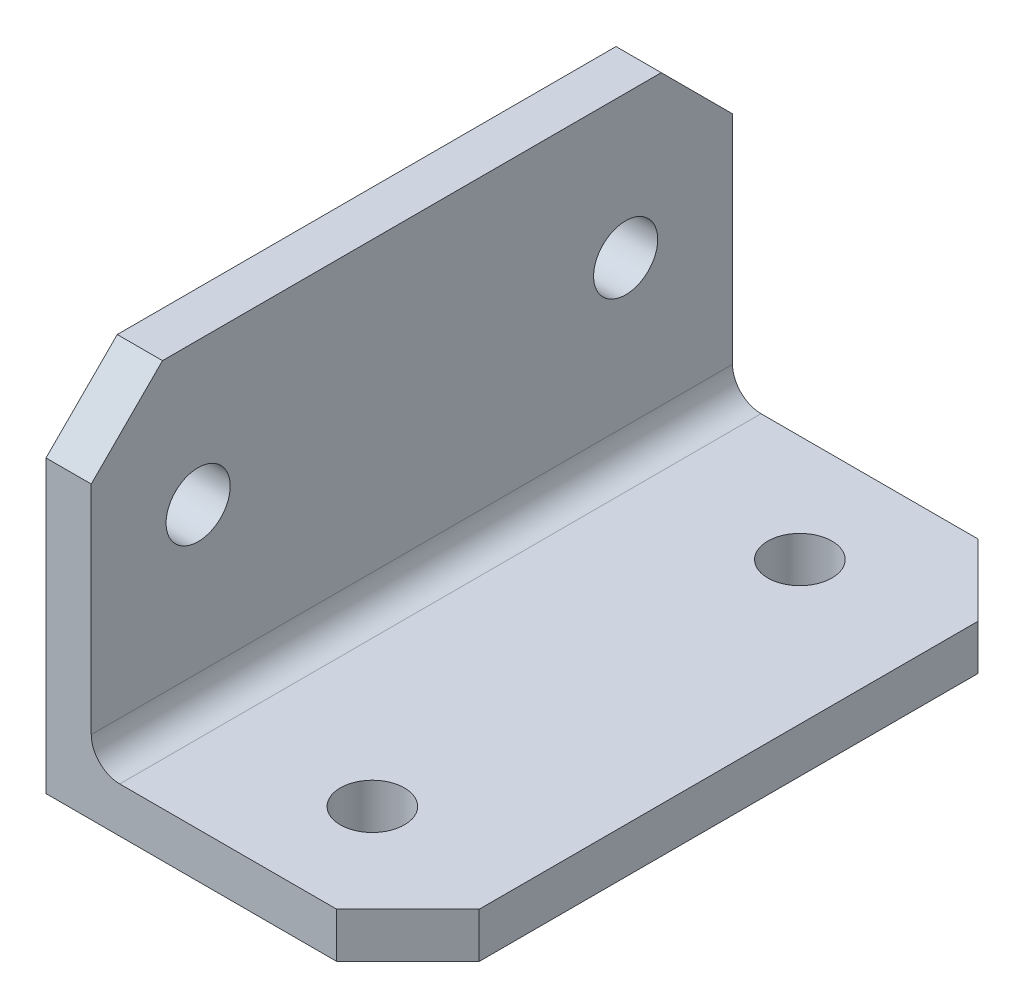
ISO-10303-21;
HEADER;
FILE_DESCRIPTION(('STEP AP214'),'2;1');
FILE_NAME('part.step','',(''),(''),'','','');
FILE_SCHEMA(('AUTOMOTIVE_DESIGN { 1 0 10303 214 1 1 1 1 }'));
ENDSEC;
DATA;
#1=APPLICATION_CONTEXT('core data for automotive mechanical design processes');
#2=APPLICATION_PROTOCOL_DEFINITION('international standard','automotive_design',2000,#1);
#3=PRODUCT_CONTEXT('',#1,'mechanical');
#4=PRODUCT('Part','Part','',(#3));
#5=PRODUCT_RELATED_PRODUCT_CATEGORY('part','',(#4));
#6=PRODUCT_DEFINITION_FORMATION('','',#4);
#7=PRODUCT_DEFINITION_CONTEXT('part definition',#1,'design');
#8=PRODUCT_DEFINITION('design','',#6,#7);
#9=PRODUCT_DEFINITION_SHAPE('','',#8);
#10=(LENGTH_UNIT() NAMED_UNIT(*) SI_UNIT(.MILLI.,.METRE.));
#11=(NAMED_UNIT(*) PLANE_ANGLE_UNIT() SI_UNIT($,.RADIAN.));
#12=(NAMED_UNIT(*) SI_UNIT($,.STERADIAN.) SOLID_ANGLE_UNIT());
#13=UNCERTAINTY_MEASURE_WITH_UNIT(LENGTH_MEASURE(1.E-05),#10,'distance_accuracy_value','');
#14=(GEOMETRIC_REPRESENTATION_CONTEXT(3) GLOBAL_UNCERTAINTY_ASSIGNED_CONTEXT((#13)) GLOBAL_UNIT_ASSIGNED_CONTEXT((#10,
#11,#12)) REPRESENTATION_CONTEXT('',''));
#15=CARTESIAN_POINT('',(0.,0.,0.));
#16=DIRECTION('',(0.,0.,1.));
#17=DIRECTION('',(1.,0.,0.));
#18=AXIS2_PLACEMENT_3D('',#15,#16,#17);
#19=CARTESIAN_POINT('',(25.4,0.,22.5));
#20=DIRECTION('',(0.,1.,0.));
#21=DIRECTION('',(-1.,0.,0.));
#22=AXIS2_PLACEMENT_3D('',#19,#20,#21);
#23=PLANE('',#22);
#24=CARTESIAN_POINT('',(15.4,0.,-15.));
#25=DIRECTION('',(0.,1.,0.));
#26=DIRECTION('',(0.,0.,1.));
#27=AXIS2_PLACEMENT_3D('',#24,#25,#26);
#28=CIRCLE('',#27,2.25);
#29=CARTESIAN_POINT('',(15.4,0.,-12.75));
#30=VERTEX_POINT('',#29);
#31=EDGE_CURVE('E356',#30,#30,#28,.T.);
#32=ORIENTED_EDGE('',*,*,#31,.T.);
#33=EDGE_LOOP('',(#32));
#34=FACE_BOUND('',#33,.T.);
#35=CARTESIAN_POINT('',(15.4,0.,15.));
#36=DIRECTION('',(0.,1.,0.));
#37=DIRECTION('',(0.,0.,1.));
#38=AXIS2_PLACEMENT_3D('',#35,#36,#37);
#39=CIRCLE('',#38,2.25);
#40=CARTESIAN_POINT('',(15.4,0.,17.25));
#41=VERTEX_POINT('',#40);
#42=EDGE_CURVE('E171',#41,#41,#39,.T.);
#43=ORIENTED_EDGE('',*,*,#42,.T.);
#44=EDGE_LOOP('',(#43));
#45=FACE_BOUND('',#44,.T.);
#46=DIRECTION('',(0.,0.,-1.));
#47=VECTOR('',#46,1.);
#48=CARTESIAN_POINT('',(25.4,0.,22.5));
#49=LINE('',#48,#47);
#50=CARTESIAN_POINT('',(25.4,0.,17.5));
#51=VERTEX_POINT('',#50);
#52=CARTESIAN_POINT('',(25.4,0.,-17.5));
#53=VERTEX_POINT('',#52);
#54=EDGE_CURVE('E193',#51,#53,#49,.T.);
#55=ORIENTED_EDGE('',*,*,#54,.F.);
#56=DIRECTION('',(0.707106781186547,0.,-0.707106781186549));
#57=VECTOR('',#56,1.);
#58=CARTESIAN_POINT('',(20.4,0.,22.5));
#59=LINE('',#58,#57);
#60=CARTESIAN_POINT('',(20.4,0.,22.5));
#61=VERTEX_POINT('',#60);
#62=EDGE_CURVE('E161',#51,#61,#59,.F.);
#63=ORIENTED_EDGE('',*,*,#62,.T.);
#64=DIRECTION('',(1.,0.,0.));
#65=VECTOR('',#64,1.);
#66=CARTESIAN_POINT('',(25.4,0.,22.5));
#67=LINE('',#66,#65);
#68=CARTESIAN_POINT('',(0.,0.,22.5));
#69=VERTEX_POINT('',#68);
#70=EDGE_CURVE('E138',#69,#61,#67,.T.);
#71=ORIENTED_EDGE('',*,*,#70,.F.);
#72=DIRECTION('',(0.,0.,-1.));
#73=VECTOR('',#72,1.);
#74=CARTESIAN_POINT('',(0.,0.,22.5));
#75=LINE('',#74,#73);
#76=CARTESIAN_POINT('',(0.,0.,-22.5));
#77=VERTEX_POINT('',#76);
#78=EDGE_CURVE('E145',#69,#77,#75,.T.);
#79=ORIENTED_EDGE('',*,*,#78,.T.);
#80=DIRECTION('',(1.,0.,0.));
#81=VECTOR('',#80,1.);
#82=CARTESIAN_POINT('',(25.4,0.,-22.5));
#83=LINE('',#82,#81);
#84=CARTESIAN_POINT('',(20.4,0.,-22.5));
#85=VERTEX_POINT('',#84);
#86=EDGE_CURVE('E176',#77,#85,#83,.T.);
#87=ORIENTED_EDGE('',*,*,#86,.T.);
#88=DIRECTION('',(0.707106781186549,0.,0.707106781186547));
#89=VECTOR('',#88,1.);
#90=CARTESIAN_POINT('',(25.4,0.,-17.5));
#91=LINE('',#90,#89);
#92=EDGE_CURVE('E230',#85,#53,#91,.T.);
#93=ORIENTED_EDGE('',*,*,#92,.T.);
#94=EDGE_LOOP('',(#55,#63,#71,#79,#87,#93));
#95=FACE_BOUND('',#94,.T.);
#96=ADVANCED_FACE('F47',(#34,#45,#95),#23,.F.);
#97=CARTESIAN_POINT('',(25.4,3.175,22.5));
#98=DIRECTION('',(-1.,0.,0.));
#99=DIRECTION('',(0.,0.,1.));
#100=AXIS2_PLACEMENT_3D('',#97,#98,#99);
#101=PLANE('',#100);
#102=DIRECTION('',(0.,0.,-1.));
#103=VECTOR('',#102,1.);
#104=CARTESIAN_POINT('',(25.4,3.175,22.5));
#105=LINE('',#104,#103);
#106=CARTESIAN_POINT('',(25.4,3.175,17.5));
#107=VERTEX_POINT('',#106);
#108=CARTESIAN_POINT('',(25.4,3.175,-17.5));
#109=VERTEX_POINT('',#108);
#110=EDGE_CURVE('E189',#107,#109,#105,.T.);
#111=ORIENTED_EDGE('',*,*,#110,.F.);
#112=DIRECTION('',(0.,-1.,0.));
#113=VECTOR('',#112,1.);
#114=CARTESIAN_POINT('',(25.4,3.175,17.5));
#115=LINE('',#114,#113);
#116=EDGE_CURVE('E227',#107,#51,#115,.T.);
#117=ORIENTED_EDGE('',*,*,#116,.T.);
#118=ORIENTED_EDGE('',*,*,#54,.T.);
#119=DIRECTION('',(0.,1.,0.));
#120=VECTOR('',#119,1.);
#121=CARTESIAN_POINT('',(25.4,3.175,-17.5));
#122=LINE('',#121,#120);
#123=EDGE_CURVE('E223',#53,#109,#122,.T.);
#124=ORIENTED_EDGE('',*,*,#123,.T.);
#125=EDGE_LOOP('',(#111,#117,#118,#124));
#126=FACE_BOUND('',#125,.T.);
#127=ADVANCED_FACE('F275',(#126),#101,.F.);
#128=CARTESIAN_POINT('',(3.175,3.175,22.5));
#129=DIRECTION('',(0.,-1.,0.));
#130=DIRECTION('',(0.,0.,-1.));
#131=AXIS2_PLACEMENT_3D('',#128,#129,#130);
#132=PLANE('',#131);
#133=CARTESIAN_POINT('',(15.4,3.175,-15.));
#134=DIRECTION('',(0.,1.,0.));
#135=DIRECTION('',(0.,0.,1.));
#136=AXIS2_PLACEMENT_3D('',#133,#134,#135);
#137=CIRCLE('',#136,2.24999999999999);
#138=CARTESIAN_POINT('',(15.4,3.175,-12.75));
#139=VERTEX_POINT('',#138);
#140=EDGE_CURVE('E346',#139,#139,#137,.T.);
#141=ORIENTED_EDGE('',*,*,#140,.F.);
#142=EDGE_LOOP('',(#141));
#143=FACE_BOUND('',#142,.T.);
#144=CARTESIAN_POINT('',(15.4,3.175,15.));
#145=DIRECTION('',(0.,1.,0.));
#146=DIRECTION('',(0.,0.,1.));
#147=AXIS2_PLACEMENT_3D('',#144,#145,#146);
#148=CIRCLE('',#147,2.24999999999999);
#149=CARTESIAN_POINT('',(15.4,3.175,17.25));
#150=VERTEX_POINT('',#149);
#151=EDGE_CURVE('E358',#150,#150,#148,.T.);
#152=ORIENTED_EDGE('',*,*,#151,.F.);
#153=EDGE_LOOP('',(#152));
#154=FACE_BOUND('',#153,.T.);
#155=DIRECTION('',(-1.,0.,0.));
#156=VECTOR('',#155,1.);
#157=CARTESIAN_POINT('',(3.175,3.175,22.5));
#158=LINE('',#157,#156);
#159=CARTESIAN_POINT('',(20.4,3.175,22.5));
#160=VERTEX_POINT('',#159);
#161=CARTESIAN_POINT('',(5.175,3.175,22.5));
#162=VERTEX_POINT('',#161);
#163=EDGE_CURVE('E163',#160,#162,#158,.T.);
#164=ORIENTED_EDGE('',*,*,#163,.F.);
#165=DIRECTION('',(-0.707106781186547,0.,0.707106781186549));
#166=VECTOR('',#165,1.);
#167=CARTESIAN_POINT('',(20.4,3.175,22.5));
#168=LINE('',#167,#166);
#169=EDGE_CURVE('E220',#160,#107,#168,.F.);
#170=ORIENTED_EDGE('',*,*,#169,.T.);
#171=ORIENTED_EDGE('',*,*,#110,.T.);
#172=DIRECTION('',(-0.707106781186549,0.,-0.707106781186547));
#173=VECTOR('',#172,1.);
#174=CARTESIAN_POINT('',(25.4,3.175,-17.5));
#175=LINE('',#174,#173);
#176=CARTESIAN_POINT('',(20.4,3.175,-22.5));
#177=VERTEX_POINT('',#176);
#178=EDGE_CURVE('E217',#109,#177,#175,.T.);
#179=ORIENTED_EDGE('',*,*,#178,.T.);
#180=DIRECTION('',(-1.,0.,0.));
#181=VECTOR('',#180,1.);
#182=CARTESIAN_POINT('',(3.175,3.175,-22.5));
#183=LINE('',#182,#181);
#184=CARTESIAN_POINT('',(5.175,3.175,-22.5));
#185=VERTEX_POINT('',#184);
#186=EDGE_CURVE('E179',#177,#185,#183,.T.);
#187=ORIENTED_EDGE('',*,*,#186,.T.);
#188=DIRECTION('',(0.,0.,-1.));
#189=VECTOR('',#188,1.);
#190=CARTESIAN_POINT('',(5.175,3.175,22.5));
#191=LINE('',#190,#189);
#192=EDGE_CURVE('E201',#185,#162,#191,.F.);
#193=ORIENTED_EDGE('',*,*,#192,.T.);
#194=EDGE_LOOP('',(#164,#170,#171,#179,#187,#193));
#195=FACE_BOUND('',#194,.T.);
#196=ADVANCED_FACE('F279',(#143,#154,#195),#132,.F.);
#197=CARTESIAN_POINT('',(3.175,25.4,22.5));
#198=DIRECTION('',(-1.,0.,0.));
#199=DIRECTION('',(0.,-1.,0.));
#200=AXIS2_PLACEMENT_3D('',#197,#198,#199);
#201=PLANE('',#200);
#202=CARTESIAN_POINT('',(3.175,15.4,15.));
#203=DIRECTION('',(1.,0.,0.));
#204=DIRECTION('',(0.,0.,-1.));
#205=AXIS2_PLACEMENT_3D('',#202,#203,#204);
#206=CIRCLE('',#205,2.24999999999999);
#207=CARTESIAN_POINT('',(3.175,15.4,12.75));
#208=VERTEX_POINT('',#207);
#209=EDGE_CURVE('E349',#208,#208,#206,.T.);
#210=ORIENTED_EDGE('',*,*,#209,.F.);
#211=EDGE_LOOP('',(#210));
#212=FACE_BOUND('',#211,.T.);
#213=CARTESIAN_POINT('',(3.175,15.4,-15.));
#214=DIRECTION('',(1.,0.,0.));
#215=DIRECTION('',(0.,0.,-1.));
#216=AXIS2_PLACEMENT_3D('',#213,#214,#215);
#217=CIRCLE('',#216,2.24999999999999);
#218=CARTESIAN_POINT('',(3.175,15.4,-17.25));
#219=VERTEX_POINT('',#218);
#220=EDGE_CURVE('E339',#219,#219,#217,.T.);
#221=ORIENTED_EDGE('',*,*,#220,.F.);
#222=EDGE_LOOP('',(#221));
#223=FACE_BOUND('',#222,.T.);
#224=DIRECTION('',(0.,1.,0.));
#225=VECTOR('',#224,1.);
#226=CARTESIAN_POINT('',(3.175,25.4,-22.5));
#227=LINE('',#226,#225);
#228=CARTESIAN_POINT('',(3.175,5.175,-22.5));
#229=VERTEX_POINT('',#228);
#230=CARTESIAN_POINT('',(3.175,20.4,-22.5));
#231=VERTEX_POINT('',#230);
#232=EDGE_CURVE('E168',#229,#231,#227,.T.);
#233=ORIENTED_EDGE('',*,*,#232,.T.);
#234=DIRECTION('',(0.,0.707106781186549,0.707106781186547));
#235=VECTOR('',#234,1.);
#236=CARTESIAN_POINT('',(3.175,25.4,-17.5));
#237=LINE('',#236,#235);
#238=CARTESIAN_POINT('',(3.175,25.4,-17.5));
#239=VERTEX_POINT('',#238);
#240=EDGE_CURVE('E11',#231,#239,#237,.T.);
#241=ORIENTED_EDGE('',*,*,#240,.T.);
#242=DIRECTION('',(0.,0.,-1.));
#243=VECTOR('',#242,1.);
#244=CARTESIAN_POINT('',(3.175,25.4,22.5));
#245=LINE('',#244,#243);
#246=CARTESIAN_POINT('',(3.175,25.4,17.5));
#247=VERTEX_POINT('',#246);
#248=EDGE_CURVE('E186',#247,#239,#245,.T.);
#249=ORIENTED_EDGE('',*,*,#248,.F.);
#250=DIRECTION('',(0.,0.707106781186547,-0.707106781186549));
#251=VECTOR('',#250,1.);
#252=CARTESIAN_POINT('',(3.175,20.4,22.5));
#253=LINE('',#252,#251);
#254=CARTESIAN_POINT('',(3.175,20.4,22.5));
#255=VERTEX_POINT('',#254);
#256=EDGE_CURVE('E57',#247,#255,#253,.F.);
#257=ORIENTED_EDGE('',*,*,#256,.T.);
#258=DIRECTION('',(0.,1.,0.));
#259=VECTOR('',#258,1.);
#260=CARTESIAN_POINT('',(3.175,25.4,22.5));
#261=LINE('',#260,#259);
#262=CARTESIAN_POINT('',(3.175,5.175,22.5));
#263=VERTEX_POINT('',#262);
#264=EDGE_CURVE('E146',#263,#255,#261,.T.);
#265=ORIENTED_EDGE('',*,*,#264,.F.);
#266=DIRECTION('',(0.,0.,-1.));
#267=VECTOR('',#266,1.);
#268=CARTESIAN_POINT('',(3.175,5.175,-22.5));
#269=LINE('',#268,#267);
#270=EDGE_CURVE('E197',#263,#229,#269,.T.);
#271=ORIENTED_EDGE('',*,*,#270,.T.);
#272=EDGE_LOOP('',(#233,#241,#249,#257,#265,#271));
#273=FACE_BOUND('',#272,.T.);
#274=ADVANCED_FACE('F255',(#212,#223,#273),#201,.F.);
#275=CARTESIAN_POINT('',(0.,25.4,22.5));
#276=DIRECTION('',(0.,-1.,0.));
#277=DIRECTION('',(0.,0.,-1.));
#278=AXIS2_PLACEMENT_3D('',#275,#276,#277);
#279=PLANE('',#278);
#280=ORIENTED_EDGE('',*,*,#248,.T.);
#281=DIRECTION('',(-1.,0.,0.));
#282=VECTOR('',#281,1.);
#283=CARTESIAN_POINT('',(0.,25.4,-17.5));
#284=LINE('',#283,#282);
#285=CARTESIAN_POINT('',(0.,25.4,-17.5));
#286=VERTEX_POINT('',#285);
#287=EDGE_CURVE('E243',#239,#286,#284,.T.);
#288=ORIENTED_EDGE('',*,*,#287,.T.);
#289=DIRECTION('',(0.,0.,-1.));
#290=VECTOR('',#289,1.);
#291=CARTESIAN_POINT('',(0.,25.4,22.5));
#292=LINE('',#291,#290);
#293=CARTESIAN_POINT('',(0.,25.4,17.5));
#294=VERTEX_POINT('',#293);
#295=EDGE_CURVE('E157',#294,#286,#292,.T.);
#296=ORIENTED_EDGE('',*,*,#295,.F.);
#297=DIRECTION('',(1.,0.,0.));
#298=VECTOR('',#297,1.);
#299=CARTESIAN_POINT('',(0.,25.4,17.5));
#300=LINE('',#299,#298);
#301=EDGE_CURVE('E69',#294,#247,#300,.T.);
#302=ORIENTED_EDGE('',*,*,#301,.T.);
#303=EDGE_LOOP('',(#280,#288,#296,#302));
#304=FACE_BOUND('',#303,.T.);
#305=ADVANCED_FACE('F259',(#304),#279,.F.);
#306=CARTESIAN_POINT('',(0.,0.,22.5));
#307=DIRECTION('',(1.,0.,0.));
#308=DIRECTION('',(0.,0.,-1.));
#309=AXIS2_PLACEMENT_3D('',#306,#307,#308);
#310=PLANE('',#309);
#311=CARTESIAN_POINT('',(0.,15.4,15.));
#312=DIRECTION('',(1.,0.,0.));
#313=DIRECTION('',(0.,0.,-1.));
#314=AXIS2_PLACEMENT_3D('',#311,#312,#313);
#315=CIRCLE('',#314,2.25);
#316=CARTESIAN_POINT('',(0.,15.4,12.75));
#317=VERTEX_POINT('',#316);
#318=EDGE_CURVE('E342',#317,#317,#315,.T.);
#319=ORIENTED_EDGE('',*,*,#318,.T.);
#320=EDGE_LOOP('',(#319));
#321=FACE_BOUND('',#320,.T.);
#322=CARTESIAN_POINT('',(0.,15.4,-15.));
#323=DIRECTION('',(1.,0.,0.));
#324=DIRECTION('',(0.,0.,-1.));
#325=AXIS2_PLACEMENT_3D('',#322,#323,#324);
#326=CIRCLE('',#325,2.25);
#327=CARTESIAN_POINT('',(0.,15.4,-17.25));
#328=VERTEX_POINT('',#327);
#329=EDGE_CURVE('E336',#328,#328,#326,.T.);
#330=ORIENTED_EDGE('',*,*,#329,.T.);
#331=EDGE_LOOP('',(#330));
#332=FACE_BOUND('',#331,.T.);
#333=ORIENTED_EDGE('',*,*,#295,.T.);
#334=DIRECTION('',(0.,-0.707106781186549,-0.707106781186547));
#335=VECTOR('',#334,1.);
#336=CARTESIAN_POINT('',(0.,25.4,-17.5));
#337=LINE('',#336,#335);
#338=CARTESIAN_POINT('',(0.,20.4,-22.5));
#339=VERTEX_POINT('',#338);
#340=EDGE_CURVE('E250',#286,#339,#337,.T.);
#341=ORIENTED_EDGE('',*,*,#340,.T.);
#342=DIRECTION('',(0.,-1.,0.));
#343=VECTOR('',#342,1.);
#344=CARTESIAN_POINT('',(0.,0.,-22.5));
#345=LINE('',#344,#343);
#346=EDGE_CURVE('E152',#339,#77,#345,.T.);
#347=ORIENTED_EDGE('',*,*,#346,.T.);
#348=ORIENTED_EDGE('',*,*,#78,.F.);
#349=DIRECTION('',(0.,-1.,0.));
#350=VECTOR('',#349,1.);
#351=CARTESIAN_POINT('',(0.,0.,22.5));
#352=LINE('',#351,#350);
#353=CARTESIAN_POINT('',(0.,20.4,22.5));
#354=VERTEX_POINT('',#353);
#355=EDGE_CURVE('E133',#354,#69,#352,.T.);
#356=ORIENTED_EDGE('',*,*,#355,.F.);
#357=DIRECTION('',(0.,-0.707106781186547,0.707106781186549));
#358=VECTOR('',#357,1.);
#359=CARTESIAN_POINT('',(0.,20.4,22.5));
#360=LINE('',#359,#358);
#361=EDGE_CURVE('E247',#354,#294,#360,.F.);
#362=ORIENTED_EDGE('',*,*,#361,.T.);
#363=EDGE_LOOP('',(#333,#341,#347,#348,#356,#362));
#364=FACE_BOUND('',#363,.T.);
#365=ADVANCED_FACE('F150',(#321,#332,#364),#310,.F.);
#366=CARTESIAN_POINT('',(0.,0.,22.5));
#367=DIRECTION('',(0.,0.,-1.));
#368=DIRECTION('',(-1.,0.,0.));
#369=AXIS2_PLACEMENT_3D('',#366,#367,#368);
#370=PLANE('',#369);
#371=ORIENTED_EDGE('',*,*,#70,.T.);
#372=DIRECTION('',(0.,1.,0.));
#373=VECTOR('',#372,1.);
#374=CARTESIAN_POINT('',(20.4,0.,22.5));
#375=LINE('',#374,#373);
#376=EDGE_CURVE('E214',#61,#160,#375,.T.);
#377=ORIENTED_EDGE('',*,*,#376,.T.);
#378=ORIENTED_EDGE('',*,*,#163,.T.);
#379=CARTESIAN_POINT('',(5.175,5.175,22.5));
#380=DIRECTION('',(0.,0.,-1.));
#381=DIRECTION('',(-1.,0.,0.));
#382=AXIS2_PLACEMENT_3D('',#379,#380,#381);
#383=CIRCLE('',#382,2.);
#384=EDGE_CURVE('E209',#162,#263,#383,.T.);
#385=ORIENTED_EDGE('',*,*,#384,.T.);
#386=ORIENTED_EDGE('',*,*,#264,.T.);
#387=DIRECTION('',(-1.,0.,0.));
#388=VECTOR('',#387,1.);
#389=CARTESIAN_POINT('',(0.,20.4,22.5));
#390=LINE('',#389,#388);
#391=EDGE_CURVE('E142',#255,#354,#390,.T.);
#392=ORIENTED_EDGE('',*,*,#391,.T.);
#393=ORIENTED_EDGE('',*,*,#355,.T.);
#394=EDGE_LOOP('',(#371,#377,#378,#385,#386,#392,#393));
#395=FACE_BOUND('',#394,.T.);
#396=ADVANCED_FACE('F135',(#395),#370,.F.);
#397=CARTESIAN_POINT('',(0.,0.,-22.5));
#398=DIRECTION('',(0.,0.,-1.));
#399=DIRECTION('',(-1.,0.,0.));
#400=AXIS2_PLACEMENT_3D('',#397,#398,#399);
#401=PLANE('',#400);
#402=ORIENTED_EDGE('',*,*,#186,.F.);
#403=DIRECTION('',(0.,-1.,0.));
#404=VECTOR('',#403,1.);
#405=CARTESIAN_POINT('',(20.4,0.,-22.5));
#406=LINE('',#405,#404);
#407=EDGE_CURVE('E238',#177,#85,#406,.T.);
#408=ORIENTED_EDGE('',*,*,#407,.T.);
#409=ORIENTED_EDGE('',*,*,#86,.F.);
#410=ORIENTED_EDGE('',*,*,#346,.F.);
#411=DIRECTION('',(1.,0.,0.));
#412=VECTOR('',#411,1.);
#413=CARTESIAN_POINT('',(3.175,20.4,-22.5));
#414=LINE('',#413,#412);
#415=EDGE_CURVE('E235',#339,#231,#414,.T.);
#416=ORIENTED_EDGE('',*,*,#415,.T.);
#417=ORIENTED_EDGE('',*,*,#232,.F.);
#418=CARTESIAN_POINT('',(5.175,5.175,-22.5));
#419=DIRECTION('',(0.,0.,-1.));
#420=DIRECTION('',(-1.,0.,0.));
#421=AXIS2_PLACEMENT_3D('',#418,#419,#420);
#422=CIRCLE('',#421,2.);
#423=EDGE_CURVE('E205',#229,#185,#422,.F.);
#424=ORIENTED_EDGE('',*,*,#423,.T.);
#425=EDGE_LOOP('',(#402,#408,#409,#410,#416,#417,#424));
#426=FACE_BOUND('',#425,.T.);
#427=ADVANCED_FACE('F266',(#426),#401,.T.);
#428=CARTESIAN_POINT('',(15.4,3.175,15.));
#429=DIRECTION('',(0.,1.,0.));
#430=DIRECTION('',(0.,0.,1.));
#431=AXIS2_PLACEMENT_3D('',#428,#429,#430);
#432=CYLINDRICAL_SURFACE('',#431,2.24999999999999);
#433=ORIENTED_EDGE('',*,*,#42,.F.);
#434=EDGE_LOOP('',(#433));
#435=FACE_BOUND('',#434,.T.);
#436=ORIENTED_EDGE('',*,*,#151,.T.);
#437=EDGE_LOOP('',(#436));
#438=FACE_BOUND('',#437,.T.);
#439=ADVANCED_FACE('F319',(#435,#438),#432,.F.);
#440=CARTESIAN_POINT('',(15.4,3.175,-15.));
#441=DIRECTION('',(0.,1.,0.));
#442=DIRECTION('',(0.,0.,1.));
#443=AXIS2_PLACEMENT_3D('',#440,#441,#442);
#444=CYLINDRICAL_SURFACE('',#443,2.24999999999999);
#445=ORIENTED_EDGE('',*,*,#31,.F.);
#446=EDGE_LOOP('',(#445));
#447=FACE_BOUND('',#446,.T.);
#448=ORIENTED_EDGE('',*,*,#140,.T.);
#449=EDGE_LOOP('',(#448));
#450=FACE_BOUND('',#449,.T.);
#451=ADVANCED_FACE('F324',(#447,#450),#444,.F.);
#452=CARTESIAN_POINT('',(3.175,15.4,-15.));
#453=DIRECTION('',(1.,0.,0.));
#454=DIRECTION('',(0.,0.,-1.));
#455=AXIS2_PLACEMENT_3D('',#452,#453,#454);
#456=CYLINDRICAL_SURFACE('',#455,2.24999999999999);
#457=ORIENTED_EDGE('',*,*,#329,.F.);
#458=EDGE_LOOP('',(#457));
#459=FACE_BOUND('',#458,.T.);
#460=ORIENTED_EDGE('',*,*,#220,.T.);
#461=EDGE_LOOP('',(#460));
#462=FACE_BOUND('',#461,.T.);
#463=ADVANCED_FACE('F294',(#459,#462),#456,.F.);
#464=CARTESIAN_POINT('',(3.175,15.4,15.));
#465=DIRECTION('',(1.,0.,0.));
#466=DIRECTION('',(0.,0.,-1.));
#467=AXIS2_PLACEMENT_3D('',#464,#465,#466);
#468=CYLINDRICAL_SURFACE('',#467,2.24999999999999);
#469=ORIENTED_EDGE('',*,*,#318,.F.);
#470=EDGE_LOOP('',(#469));
#471=FACE_BOUND('',#470,.T.);
#472=ORIENTED_EDGE('',*,*,#209,.T.);
#473=EDGE_LOOP('',(#472));
#474=FACE_BOUND('',#473,.T.);
#475=ADVANCED_FACE('F286',(#471,#474),#468,.F.);
#476=CARTESIAN_POINT('',(5.175,5.175,22.5));
#477=DIRECTION('',(0.,0.,1.));
#478=DIRECTION('',(1.,0.,0.));
#479=AXIS2_PLACEMENT_3D('',#476,#477,#478);
#480=CYLINDRICAL_SURFACE('',#479,2.);
#481=ORIENTED_EDGE('',*,*,#384,.F.);
#482=ORIENTED_EDGE('',*,*,#192,.F.);
#483=ORIENTED_EDGE('',*,*,#423,.F.);
#484=ORIENTED_EDGE('',*,*,#270,.F.);
#485=EDGE_LOOP('',(#481,#482,#483,#484));
#486=FACE_BOUND('',#485,.T.);
#487=ADVANCED_FACE('F284',(#486),#480,.F.);
#488=CARTESIAN_POINT('',(20.4,0.,22.5));
#489=DIRECTION('',(-0.707106781186549,0.,-0.707106781186547));
#490=DIRECTION('',(0.,1.,0.));
#491=AXIS2_PLACEMENT_3D('',#488,#489,#490);
#492=PLANE('',#491);
#493=ORIENTED_EDGE('',*,*,#62,.F.);
#494=ORIENTED_EDGE('',*,*,#116,.F.);
#495=ORIENTED_EDGE('',*,*,#169,.F.);
#496=ORIENTED_EDGE('',*,*,#376,.F.);
#497=EDGE_LOOP('',(#493,#494,#495,#496));
#498=FACE_BOUND('',#497,.T.);
#499=ADVANCED_FACE('F281',(#498),#492,.F.);
#500=CARTESIAN_POINT('',(25.4,3.175,-17.5));
#501=DIRECTION('',(0.707106781186547,0.,-0.707106781186549));
#502=DIRECTION('',(0.,-1.,0.));
#503=AXIS2_PLACEMENT_3D('',#500,#501,#502);
#504=PLANE('',#503);
#505=ORIENTED_EDGE('',*,*,#92,.F.);
#506=ORIENTED_EDGE('',*,*,#407,.F.);
#507=ORIENTED_EDGE('',*,*,#178,.F.);
#508=ORIENTED_EDGE('',*,*,#123,.F.);
#509=EDGE_LOOP('',(#505,#506,#507,#508));
#510=FACE_BOUND('',#509,.T.);
#511=ADVANCED_FACE('F272',(#510),#504,.T.);
#512=CARTESIAN_POINT('',(0.,25.4,-17.5));
#513=DIRECTION('',(0.,0.707106781186547,-0.707106781186549));
#514=DIRECTION('',(1.,0.,0.));
#515=AXIS2_PLACEMENT_3D('',#512,#513,#514);
#516=PLANE('',#515);
#517=ORIENTED_EDGE('',*,*,#240,.F.);
#518=ORIENTED_EDGE('',*,*,#415,.F.);
#519=ORIENTED_EDGE('',*,*,#340,.F.);
#520=ORIENTED_EDGE('',*,*,#287,.F.);
#521=EDGE_LOOP('',(#517,#518,#519,#520));
#522=FACE_BOUND('',#521,.T.);
#523=ADVANCED_FACE('F262',(#522),#516,.T.);
#524=CARTESIAN_POINT('',(0.,20.4,22.5));
#525=DIRECTION('',(0.,-0.707106781186549,-0.707106781186547));
#526=DIRECTION('',(-1.,0.,0.));
#527=AXIS2_PLACEMENT_3D('',#524,#525,#526);
#528=PLANE('',#527);
#529=ORIENTED_EDGE('',*,*,#256,.F.);
#530=ORIENTED_EDGE('',*,*,#301,.F.);
#531=ORIENTED_EDGE('',*,*,#361,.F.);
#532=ORIENTED_EDGE('',*,*,#391,.F.);
#533=EDGE_LOOP('',(#529,#530,#531,#532));
#534=FACE_BOUND('',#533,.T.);
#535=ADVANCED_FACE('F50',(#534),#528,.F.);
#536=CLOSED_SHELL('',(#96,#127,#196,#274,#305,#365,#396,#427,#439,#451,#463,#475,#487,#499,#511,
#523,#535));
#537=MANIFOLD_SOLID_BREP('B2',#536);
#538=ADVANCED_BREP_SHAPE_REPRESENTATION('',(#18,#537),#14);
#539=SHAPE_DEFINITION_REPRESENTATION(#9,#538);
ENDSEC;
END-ISO-10303-21;
